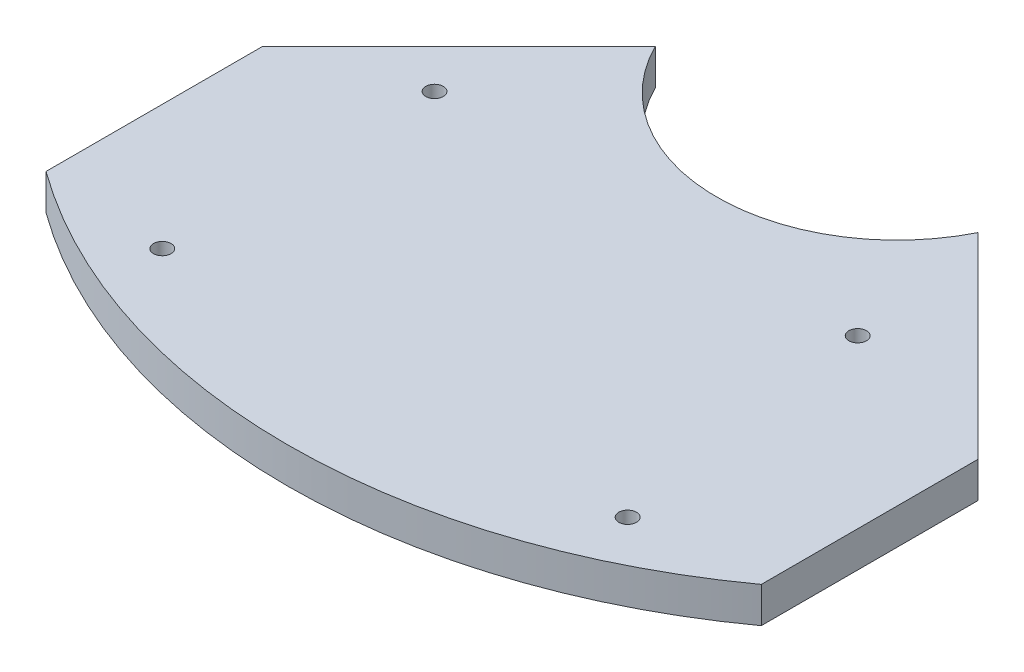
ISO-10303-21;
HEADER;
FILE_DESCRIPTION(('STEP AP214'),'2;1');
FILE_NAME('part.step','',(''),(''),'','','');
FILE_SCHEMA(('AUTOMOTIVE_DESIGN { 1 0 10303 214 1 1 1 1 }'));
ENDSEC;
DATA;
#1=APPLICATION_CONTEXT('core data for automotive mechanical design processes');
#2=APPLICATION_PROTOCOL_DEFINITION('international standard','automotive_design',2000,#1);
#3=PRODUCT_CONTEXT('',#1,'mechanical');
#4=PRODUCT('Part','Part','',(#3));
#5=PRODUCT_RELATED_PRODUCT_CATEGORY('part','',(#4));
#6=PRODUCT_DEFINITION_FORMATION('','',#4);
#7=PRODUCT_DEFINITION_CONTEXT('part definition',#1,'design');
#8=PRODUCT_DEFINITION('design','',#6,#7);
#9=PRODUCT_DEFINITION_SHAPE('','',#8);
#10=(LENGTH_UNIT() NAMED_UNIT(*) SI_UNIT(.MILLI.,.METRE.));
#11=(NAMED_UNIT(*) PLANE_ANGLE_UNIT() SI_UNIT($,.RADIAN.));
#12=(NAMED_UNIT(*) SI_UNIT($,.STERADIAN.) SOLID_ANGLE_UNIT());
#13=UNCERTAINTY_MEASURE_WITH_UNIT(LENGTH_MEASURE(1.E-05),#10,'distance_accuracy_value','');
#14=(GEOMETRIC_REPRESENTATION_CONTEXT(3) GLOBAL_UNCERTAINTY_ASSIGNED_CONTEXT((#13)) GLOBAL_UNIT_ASSIGNED_CONTEXT((#10,
#11,#12)) REPRESENTATION_CONTEXT('',''));
#15=CARTESIAN_POINT('',(0.,0.,0.));
#16=DIRECTION('',(0.,0.,1.));
#17=DIRECTION('',(1.,0.,0.));
#18=AXIS2_PLACEMENT_3D('',#15,#16,#17);
#19=CARTESIAN_POINT('',(0.,6.35,-108.204));
#20=DIRECTION('',(0.,-1.,0.));
#21=DIRECTION('',(0.,0.,-1.));
#22=AXIS2_PLACEMENT_3D('',#19,#20,#21);
#23=CYLINDRICAL_SURFACE('',#22,32.004);
#24=CARTESIAN_POINT('',(0.,0.,-108.204));
#25=DIRECTION('',(0.,-1.,0.));
#26=DIRECTION('',(0.,0.,1.));
#27=AXIS2_PLACEMENT_3D('',#24,#25,#26);
#28=CIRCLE('',#27,32.004);
#29=CARTESIAN_POINT('',(28.6438229736058,0.,-93.9285868201046));
#30=VERTEX_POINT('',#29);
#31=CARTESIAN_POINT('',(-28.6438229736058,0.,-93.9285868201046));
#32=VERTEX_POINT('',#31);
#33=EDGE_CURVE('E108',#30,#32,#28,.T.);
#34=ORIENTED_EDGE('',*,*,#33,.T.);
#35=DIRECTION('',(0.,-1.,0.));
#36=VECTOR('',#35,1.);
#37=CARTESIAN_POINT('',(-28.6438229736058,6.35,-93.9285868201046));
#38=LINE('',#37,#36);
#39=CARTESIAN_POINT('',(-28.6438229736058,6.35,-93.9285868201046));
#40=VERTEX_POINT('',#39);
#41=EDGE_CURVE('E11',#40,#32,#38,.T.);
#42=ORIENTED_EDGE('',*,*,#41,.F.);
#43=CARTESIAN_POINT('',(0.,6.35,-108.204));
#44=DIRECTION('',(0.,-1.,0.));
#45=DIRECTION('',(0.,0.,1.));
#46=AXIS2_PLACEMENT_3D('',#43,#44,#45);
#47=CIRCLE('',#46,32.004);
#48=CARTESIAN_POINT('',(28.6438229736058,6.35,-93.9285868201046));
#49=VERTEX_POINT('',#48);
#50=EDGE_CURVE('E129',#49,#40,#47,.T.);
#51=ORIENTED_EDGE('',*,*,#50,.F.);
#52=DIRECTION('',(0.,-1.,0.));
#53=VECTOR('',#52,1.);
#54=CARTESIAN_POINT('',(28.6438229736058,6.35,-93.9285868201046));
#55=LINE('',#54,#53);
#56=EDGE_CURVE('E115',#49,#30,#55,.T.);
#57=ORIENTED_EDGE('',*,*,#56,.T.);
#58=EDGE_LOOP('',(#34,#42,#51,#57));
#59=FACE_BOUND('',#58,.T.);
#60=ADVANCED_FACE('F33',(#59),#23,.F.);
#61=CARTESIAN_POINT('',(-28.6438229736058,6.35,-93.9285868201046));
#62=DIRECTION('',(0.707106781186551,0.,0.707106781186544));
#63=DIRECTION('',(0.707106781186544,0.,-0.707106781186551));
#64=AXIS2_PLACEMENT_3D('',#61,#62,#63);
#65=PLANE('',#64);
#66=DIRECTION('',(-0.707106781186544,0.,0.707106781186552));
#67=VECTOR('',#66,1.);
#68=CARTESIAN_POINT('',(-28.6438229736058,0.,-93.9285868201046));
#69=LINE('',#68,#67);
#70=CARTESIAN_POINT('',(-63.5,0.,-59.07240979371));
#71=VERTEX_POINT('',#70);
#72=EDGE_CURVE('E62',#32,#71,#69,.T.);
#73=ORIENTED_EDGE('',*,*,#72,.T.);
#74=DIRECTION('',(0.,-1.,0.));
#75=VECTOR('',#74,1.);
#76=CARTESIAN_POINT('',(-63.5,6.35,-59.07240979371));
#77=LINE('',#76,#75);
#78=CARTESIAN_POINT('',(-63.5,6.35,-59.07240979371));
#79=VERTEX_POINT('',#78);
#80=EDGE_CURVE('E41',#79,#71,#77,.T.);
#81=ORIENTED_EDGE('',*,*,#80,.F.);
#82=DIRECTION('',(-0.707106781186544,0.,0.707106781186552));
#83=VECTOR('',#82,1.);
#84=CARTESIAN_POINT('',(-28.6438229736058,6.35,-93.9285868201046));
#85=LINE('',#84,#83);
#86=EDGE_CURVE('E70',#40,#79,#85,.T.);
#87=ORIENTED_EDGE('',*,*,#86,.F.);
#88=ORIENTED_EDGE('',*,*,#41,.T.);
#89=EDGE_LOOP('',(#73,#81,#87,#88));
#90=FACE_BOUND('',#89,.T.);
#91=ADVANCED_FACE('F147',(#90),#65,.F.);
#92=CARTESIAN_POINT('',(-63.5,6.35,-59.07240979371));
#93=DIRECTION('',(1.,0.,0.));
#94=DIRECTION('',(0.,0.,-1.));
#95=AXIS2_PLACEMENT_3D('',#92,#93,#94);
#96=PLANE('',#95);
#97=DIRECTION('',(0.,0.,1.));
#98=VECTOR('',#97,1.);
#99=CARTESIAN_POINT('',(-63.5,0.,-59.07240979371));
#100=LINE('',#99,#98);
#101=CARTESIAN_POINT('',(-63.5,0.,-20.5920395379718));
#102=VERTEX_POINT('',#101);
#103=EDGE_CURVE('E67',#71,#102,#100,.T.);
#104=ORIENTED_EDGE('',*,*,#103,.T.);
#105=DIRECTION('',(0.,-1.,0.));
#106=VECTOR('',#105,1.);
#107=CARTESIAN_POINT('',(-63.5,6.35,-20.5920395379718));
#108=LINE('',#107,#106);
#109=CARTESIAN_POINT('',(-63.5,6.35,-20.5920395379718));
#110=VERTEX_POINT('',#109);
#111=EDGE_CURVE('E98',#110,#102,#108,.T.);
#112=ORIENTED_EDGE('',*,*,#111,.F.);
#113=DIRECTION('',(0.,0.,1.));
#114=VECTOR('',#113,1.);
#115=CARTESIAN_POINT('',(-63.5,6.35,-59.07240979371));
#116=LINE('',#115,#114);
#117=EDGE_CURVE('E49',#79,#110,#116,.T.);
#118=ORIENTED_EDGE('',*,*,#117,.F.);
#119=ORIENTED_EDGE('',*,*,#80,.T.);
#120=EDGE_LOOP('',(#104,#112,#118,#119));
#121=FACE_BOUND('',#120,.T.);
#122=ADVANCED_FACE('F138',(#121),#96,.F.);
#123=CARTESIAN_POINT('',(0.,6.35,-108.204));
#124=DIRECTION('',(0.,-1.,0.));
#125=DIRECTION('',(0.,0.,-1.));
#126=AXIS2_PLACEMENT_3D('',#123,#124,#125);
#127=CYLINDRICAL_SURFACE('',#126,108.204);
#128=CARTESIAN_POINT('',(0.,0.,-108.204));
#129=DIRECTION('',(0.,1.,0.));
#130=DIRECTION('',(0.,0.,1.));
#131=AXIS2_PLACEMENT_3D('',#128,#129,#130);
#132=CIRCLE('',#131,108.204);
#133=CARTESIAN_POINT('',(63.5,0.,-20.5920395379718));
#134=VERTEX_POINT('',#133);
#135=EDGE_CURVE('E104',#102,#134,#132,.T.);
#136=ORIENTED_EDGE('',*,*,#135,.T.);
#137=DIRECTION('',(0.,-1.,0.));
#138=VECTOR('',#137,1.);
#139=CARTESIAN_POINT('',(63.5,6.35,-20.5920395379718));
#140=LINE('',#139,#138);
#141=CARTESIAN_POINT('',(63.5,6.35,-20.5920395379718));
#142=VERTEX_POINT('',#141);
#143=EDGE_CURVE('E101',#142,#134,#140,.T.);
#144=ORIENTED_EDGE('',*,*,#143,.F.);
#145=CARTESIAN_POINT('',(0.,6.35,-108.204));
#146=DIRECTION('',(0.,1.,0.));
#147=DIRECTION('',(0.,0.,1.));
#148=AXIS2_PLACEMENT_3D('',#145,#146,#147);
#149=CIRCLE('',#148,108.204);
#150=EDGE_CURVE('E90',#110,#142,#149,.T.);
#151=ORIENTED_EDGE('',*,*,#150,.F.);
#152=ORIENTED_EDGE('',*,*,#111,.T.);
#153=EDGE_LOOP('',(#136,#144,#151,#152));
#154=FACE_BOUND('',#153,.T.);
#155=ADVANCED_FACE('F102',(#154),#127,.T.);
#156=CARTESIAN_POINT('',(0.,6.35,-108.204));
#157=DIRECTION('',(0.,1.,0.));
#158=DIRECTION('',(0.,0.,1.));
#159=AXIS2_PLACEMENT_3D('',#156,#157,#158);
#160=PLANE('',#159);
#161=CARTESIAN_POINT('',(41.3131,6.35,-19.05));
#162=DIRECTION('',(0.,1.,0.));
#163=DIRECTION('',(0.,0.,-1.));
#164=AXIS2_PLACEMENT_3D('',#161,#162,#163);
#165=CIRCLE('',#164,1.5621);
#166=CARTESIAN_POINT('',(41.3131,6.35,-20.6121));
#167=VERTEX_POINT('',#166);
#168=EDGE_CURVE('E189',#167,#167,#165,.T.);
#169=ORIENTED_EDGE('',*,*,#168,.F.);
#170=EDGE_LOOP('',(#169));
#171=FACE_BOUND('',#170,.T.);
#172=CARTESIAN_POINT('',(-41.3131,6.35,-67.3862));
#173=DIRECTION('',(0.,1.,0.));
#174=DIRECTION('',(0.,0.,1.));
#175=AXIS2_PLACEMENT_3D('',#172,#173,#174);
#176=CIRCLE('',#175,1.5621);
#177=CARTESIAN_POINT('',(-41.3131,6.35,-65.8241));
#178=VERTEX_POINT('',#177);
#179=EDGE_CURVE('E200',#178,#178,#176,.T.);
#180=ORIENTED_EDGE('',*,*,#179,.F.);
#181=EDGE_LOOP('',(#180));
#182=FACE_BOUND('',#181,.T.);
#183=CARTESIAN_POINT('',(-41.3131,6.35,-19.05));
#184=DIRECTION('',(0.,1.,0.));
#185=DIRECTION('',(0.,0.,1.));
#186=AXIS2_PLACEMENT_3D('',#183,#184,#185);
#187=CIRCLE('',#186,1.5621);
#188=CARTESIAN_POINT('',(-41.3131,6.35,-17.4879));
#189=VERTEX_POINT('',#188);
#190=EDGE_CURVE('E121',#189,#189,#187,.T.);
#191=ORIENTED_EDGE('',*,*,#190,.F.);
#192=EDGE_LOOP('',(#191));
#193=FACE_BOUND('',#192,.T.);
#194=CARTESIAN_POINT('',(33.8201,6.35,-67.3862));
#195=DIRECTION('',(0.,1.,0.));
#196=DIRECTION('',(0.,0.,1.));
#197=AXIS2_PLACEMENT_3D('',#194,#195,#196);
#198=CIRCLE('',#197,1.5621);
#199=CARTESIAN_POINT('',(33.8201,6.35,-65.8241));
#200=VERTEX_POINT('',#199);
#201=EDGE_CURVE('E194',#200,#200,#198,.T.);
#202=ORIENTED_EDGE('',*,*,#201,.F.);
#203=EDGE_LOOP('',(#202));
#204=FACE_BOUND('',#203,.T.);
#205=ORIENTED_EDGE('',*,*,#50,.T.);
#206=ORIENTED_EDGE('',*,*,#86,.T.);
#207=ORIENTED_EDGE('',*,*,#117,.T.);
#208=ORIENTED_EDGE('',*,*,#150,.T.);
#209=DIRECTION('',(0.,0.,1.));
#210=VECTOR('',#209,1.);
#211=CARTESIAN_POINT('',(63.5,6.35,-59.07240979371));
#212=LINE('',#211,#210);
#213=CARTESIAN_POINT('',(63.5,6.35,-59.07240979371));
#214=VERTEX_POINT('',#213);
#215=EDGE_CURVE('E95',#214,#142,#212,.T.);
#216=ORIENTED_EDGE('',*,*,#215,.F.);
#217=DIRECTION('',(0.707106781186544,0.,0.707106781186552));
#218=VECTOR('',#217,1.);
#219=CARTESIAN_POINT('',(28.6438229736058,6.35,-93.9285868201046));
#220=LINE('',#219,#218);
#221=EDGE_CURVE('E112',#49,#214,#220,.T.);
#222=ORIENTED_EDGE('',*,*,#221,.F.);
#223=EDGE_LOOP('',(#205,#206,#207,#208,#216,#222));
#224=FACE_BOUND('',#223,.T.);
#225=ADVANCED_FACE('F92',(#171,#182,#193,#204,#224),#160,.T.);
#226=CARTESIAN_POINT('',(0.,0.,-108.204));
#227=DIRECTION('',(0.,1.,0.));
#228=DIRECTION('',(0.,0.,1.));
#229=AXIS2_PLACEMENT_3D('',#226,#227,#228);
#230=PLANE('',#229);
#231=CARTESIAN_POINT('',(41.3131,0.,-19.05));
#232=DIRECTION('',(0.,1.,0.));
#233=DIRECTION('',(0.,0.,-1.));
#234=AXIS2_PLACEMENT_3D('',#231,#232,#233);
#235=CIRCLE('',#234,1.5621);
#236=CARTESIAN_POINT('',(41.3131,0.,-20.6121));
#237=VERTEX_POINT('',#236);
#238=EDGE_CURVE('E124',#237,#237,#235,.T.);
#239=ORIENTED_EDGE('',*,*,#238,.T.);
#240=EDGE_LOOP('',(#239));
#241=FACE_BOUND('',#240,.T.);
#242=CARTESIAN_POINT('',(-41.3131,0.,-67.3862));
#243=DIRECTION('',(0.,1.,0.));
#244=DIRECTION('',(0.,0.,1.));
#245=AXIS2_PLACEMENT_3D('',#242,#243,#244);
#246=CIRCLE('',#245,1.5621);
#247=CARTESIAN_POINT('',(-41.3131,0.,-65.8241));
#248=VERTEX_POINT('',#247);
#249=EDGE_CURVE('E197',#248,#248,#246,.T.);
#250=ORIENTED_EDGE('',*,*,#249,.T.);
#251=EDGE_LOOP('',(#250));
#252=FACE_BOUND('',#251,.T.);
#253=CARTESIAN_POINT('',(-41.3131,0.,-19.05));
#254=DIRECTION('',(0.,1.,0.));
#255=DIRECTION('',(0.,0.,1.));
#256=AXIS2_PLACEMENT_3D('',#253,#254,#255);
#257=CIRCLE('',#256,1.5621);
#258=CARTESIAN_POINT('',(-41.3131,0.,-17.4879));
#259=VERTEX_POINT('',#258);
#260=EDGE_CURVE('E204',#259,#259,#257,.T.);
#261=ORIENTED_EDGE('',*,*,#260,.T.);
#262=EDGE_LOOP('',(#261));
#263=FACE_BOUND('',#262,.T.);
#264=CARTESIAN_POINT('',(33.8201,0.,-67.3862));
#265=DIRECTION('',(0.,1.,0.));
#266=DIRECTION('',(0.,0.,1.));
#267=AXIS2_PLACEMENT_3D('',#264,#265,#266);
#268=CIRCLE('',#267,1.5621);
#269=CARTESIAN_POINT('',(33.8201,0.,-65.8241));
#270=VERTEX_POINT('',#269);
#271=EDGE_CURVE('E190',#270,#270,#268,.T.);
#272=ORIENTED_EDGE('',*,*,#271,.T.);
#273=EDGE_LOOP('',(#272));
#274=FACE_BOUND('',#273,.T.);
#275=ORIENTED_EDGE('',*,*,#33,.F.);
#276=DIRECTION('',(0.707106781186544,0.,0.707106781186552));
#277=VECTOR('',#276,1.);
#278=CARTESIAN_POINT('',(28.6438229736058,0.,-93.9285868201046));
#279=LINE('',#278,#277);
#280=CARTESIAN_POINT('',(63.5,0.,-59.07240979371));
#281=VERTEX_POINT('',#280);
#282=EDGE_CURVE('E113',#30,#281,#279,.T.);
#283=ORIENTED_EDGE('',*,*,#282,.T.);
#284=DIRECTION('',(0.,0.,1.));
#285=VECTOR('',#284,1.);
#286=CARTESIAN_POINT('',(63.5,0.,-59.07240979371));
#287=LINE('',#286,#285);
#288=EDGE_CURVE('E118',#281,#134,#287,.T.);
#289=ORIENTED_EDGE('',*,*,#288,.T.);
#290=ORIENTED_EDGE('',*,*,#135,.F.);
#291=ORIENTED_EDGE('',*,*,#103,.F.);
#292=ORIENTED_EDGE('',*,*,#72,.F.);
#293=EDGE_LOOP('',(#275,#283,#289,#290,#291,#292));
#294=FACE_BOUND('',#293,.T.);
#295=ADVANCED_FACE('F140',(#241,#252,#263,#274,#294),#230,.F.);
#296=CARTESIAN_POINT('',(63.5,6.35,-59.07240979371));
#297=DIRECTION('',(1.,0.,0.));
#298=DIRECTION('',(0.,0.,-1.));
#299=AXIS2_PLACEMENT_3D('',#296,#297,#298);
#300=PLANE('',#299);
#301=ORIENTED_EDGE('',*,*,#288,.F.);
#302=DIRECTION('',(0.,-1.,0.));
#303=VECTOR('',#302,1.);
#304=CARTESIAN_POINT('',(63.5,6.35,-59.07240979371));
#305=LINE('',#304,#303);
#306=EDGE_CURVE('E109',#214,#281,#305,.T.);
#307=ORIENTED_EDGE('',*,*,#306,.F.);
#308=ORIENTED_EDGE('',*,*,#215,.T.);
#309=ORIENTED_EDGE('',*,*,#143,.T.);
#310=EDGE_LOOP('',(#301,#307,#308,#309));
#311=FACE_BOUND('',#310,.T.);
#312=ADVANCED_FACE('F111',(#311),#300,.T.);
#313=CARTESIAN_POINT('',(28.6438229736058,6.35,-93.9285868201046));
#314=DIRECTION('',(0.707106781186551,0.,-0.707106781186544));
#315=DIRECTION('',(-0.707106781186544,0.,-0.707106781186551));
#316=AXIS2_PLACEMENT_3D('',#313,#314,#315);
#317=PLANE('',#316);
#318=ORIENTED_EDGE('',*,*,#282,.F.);
#319=ORIENTED_EDGE('',*,*,#56,.F.);
#320=ORIENTED_EDGE('',*,*,#221,.T.);
#321=ORIENTED_EDGE('',*,*,#306,.T.);
#322=EDGE_LOOP('',(#318,#319,#320,#321));
#323=FACE_BOUND('',#322,.T.);
#324=ADVANCED_FACE('F144',(#323),#317,.T.);
#325=CARTESIAN_POINT('',(33.8201,0.,-67.3862));
#326=DIRECTION('',(0.,1.,0.));
#327=DIRECTION('',(0.,0.,1.));
#328=AXIS2_PLACEMENT_3D('',#325,#326,#327);
#329=CYLINDRICAL_SURFACE('',#328,1.5621);
#330=ORIENTED_EDGE('',*,*,#271,.F.);
#331=EDGE_LOOP('',(#330));
#332=FACE_BOUND('',#331,.T.);
#333=ORIENTED_EDGE('',*,*,#201,.T.);
#334=EDGE_LOOP('',(#333));
#335=FACE_BOUND('',#334,.T.);
#336=ADVANCED_FACE('F167',(#332,#335),#329,.F.);
#337=CARTESIAN_POINT('',(-41.3131,0.,-19.05));
#338=DIRECTION('',(0.,1.,0.));
#339=DIRECTION('',(0.,0.,1.));
#340=AXIS2_PLACEMENT_3D('',#337,#338,#339);
#341=CYLINDRICAL_SURFACE('',#340,1.5621);
#342=ORIENTED_EDGE('',*,*,#260,.F.);
#343=EDGE_LOOP('',(#342));
#344=FACE_BOUND('',#343,.T.);
#345=ORIENTED_EDGE('',*,*,#190,.T.);
#346=EDGE_LOOP('',(#345));
#347=FACE_BOUND('',#346,.T.);
#348=ADVANCED_FACE('F168',(#344,#347),#341,.F.);
#349=CARTESIAN_POINT('',(-41.3131,0.,-67.3862));
#350=DIRECTION('',(0.,1.,0.));
#351=DIRECTION('',(0.,0.,1.));
#352=AXIS2_PLACEMENT_3D('',#349,#350,#351);
#353=CYLINDRICAL_SURFACE('',#352,1.5621);
#354=ORIENTED_EDGE('',*,*,#249,.F.);
#355=EDGE_LOOP('',(#354));
#356=FACE_BOUND('',#355,.T.);
#357=ORIENTED_EDGE('',*,*,#179,.T.);
#358=EDGE_LOOP('',(#357));
#359=FACE_BOUND('',#358,.T.);
#360=ADVANCED_FACE('F171',(#356,#359),#353,.F.);
#361=CARTESIAN_POINT('',(41.3131,0.,-19.05));
#362=DIRECTION('',(0.,1.,0.));
#363=DIRECTION('',(0.,0.,1.));
#364=AXIS2_PLACEMENT_3D('',#361,#362,#363);
#365=CYLINDRICAL_SURFACE('',#364,1.5621);
#366=ORIENTED_EDGE('',*,*,#238,.F.);
#367=EDGE_LOOP('',(#366));
#368=FACE_BOUND('',#367,.T.);
#369=ORIENTED_EDGE('',*,*,#168,.T.);
#370=EDGE_LOOP('',(#369));
#371=FACE_BOUND('',#370,.T.);
#372=ADVANCED_FACE('F178',(#368,#371),#365,.F.);
#373=CLOSED_SHELL('',(#60,#91,#122,#155,#225,#295,#312,#324,#336,#348,#360,#372));
#374=MANIFOLD_SOLID_BREP('B2',#373);
#375=ADVANCED_BREP_SHAPE_REPRESENTATION('',(#18,#374),#14);
#376=SHAPE_DEFINITION_REPRESENTATION(#9,#375);
ENDSEC;
END-ISO-10303-21;
